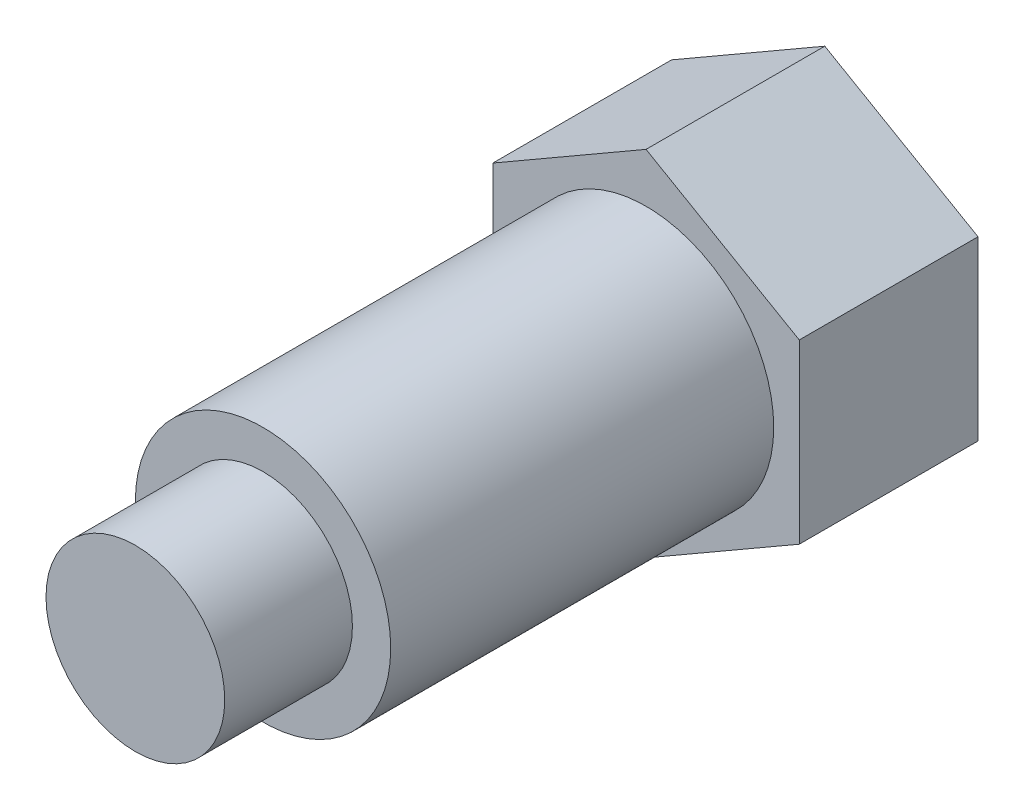
ISO-10303-21;
HEADER;
FILE_DESCRIPTION(('STEP AP214'),'2;1');
FILE_NAME('part.step','',(''),(''),'','','');
FILE_SCHEMA(('AUTOMOTIVE_DESIGN { 1 0 10303 214 1 1 1 1 }'));
ENDSEC;
DATA;
#1=APPLICATION_CONTEXT('core data for automotive mechanical design processes');
#2=APPLICATION_PROTOCOL_DEFINITION('international standard','automotive_design',2000,#1);
#3=PRODUCT_CONTEXT('',#1,'mechanical');
#4=PRODUCT('Part','Part','',(#3));
#5=PRODUCT_RELATED_PRODUCT_CATEGORY('part','',(#4));
#6=PRODUCT_DEFINITION_FORMATION('','',#4);
#7=PRODUCT_DEFINITION_CONTEXT('part definition',#1,'design');
#8=PRODUCT_DEFINITION('design','',#6,#7);
#9=PRODUCT_DEFINITION_SHAPE('','',#8);
#10=(LENGTH_UNIT() NAMED_UNIT(*) SI_UNIT(.MILLI.,.METRE.));
#11=(NAMED_UNIT(*) PLANE_ANGLE_UNIT() SI_UNIT($,.RADIAN.));
#12=(NAMED_UNIT(*) SI_UNIT($,.STERADIAN.) SOLID_ANGLE_UNIT());
#13=UNCERTAINTY_MEASURE_WITH_UNIT(LENGTH_MEASURE(1.E-05),#10,'distance_accuracy_value','');
#14=(GEOMETRIC_REPRESENTATION_CONTEXT(3) GLOBAL_UNCERTAINTY_ASSIGNED_CONTEXT((#13)) GLOBAL_UNIT_ASSIGNED_CONTEXT((#10,
#11,#12)) REPRESENTATION_CONTEXT('',''));
#15=CARTESIAN_POINT('',(0.,0.,0.));
#16=DIRECTION('',(0.,0.,1.));
#17=DIRECTION('',(1.,0.,0.));
#18=AXIS2_PLACEMENT_3D('',#15,#16,#17);
#19=CARTESIAN_POINT('',(0.,0.,20.));
#20=DIRECTION('',(0.,0.,-1.));
#21=DIRECTION('',(-1.,0.,0.));
#22=AXIS2_PLACEMENT_3D('',#19,#20,#21);
#23=PLANE('',#22);
#24=CARTESIAN_POINT('',(0.,0.,20.));
#25=DIRECTION('',(0.,0.,-1.));
#26=DIRECTION('',(-1.,0.,0.));
#27=AXIS2_PLACEMENT_3D('',#24,#25,#26);
#28=CIRCLE('',#27,3.5);
#29=CARTESIAN_POINT('',(-3.50000000000001,0.,20.));
#30=VERTEX_POINT('',#29);
#31=EDGE_CURVE('E11',#30,#30,#28,.T.);
#32=ORIENTED_EDGE('',*,*,#31,.F.);
#33=EDGE_LOOP('',(#32));
#34=FACE_BOUND('',#33,.T.);
#35=ADVANCED_FACE('F37',(#34),#23,.F.);
#36=CARTESIAN_POINT('',(0.,0.,-1.18729932832295));
#37=DIRECTION('',(0.,0.,-1.));
#38=DIRECTION('',(-1.,0.,0.));
#39=AXIS2_PLACEMENT_3D('',#36,#37,#38);
#40=CYLINDRICAL_SURFACE('',#39,3.5);
#41=CARTESIAN_POINT('',(0.,0.,15.));
#42=DIRECTION('',(0.,0.,-1.));
#43=DIRECTION('',(-1.,0.,0.));
#44=AXIS2_PLACEMENT_3D('',#41,#42,#43);
#45=CIRCLE('',#44,3.5);
#46=CARTESIAN_POINT('',(-3.50000000000001,0.,15.));
#47=VERTEX_POINT('',#46);
#48=EDGE_CURVE('E45',#47,#47,#45,.T.);
#49=ORIENTED_EDGE('',*,*,#48,.F.);
#50=EDGE_LOOP('',(#49));
#51=FACE_BOUND('',#50,.T.);
#52=ORIENTED_EDGE('',*,*,#31,.T.);
#53=EDGE_LOOP('',(#52));
#54=FACE_BOUND('',#53,.T.);
#55=ADVANCED_FACE('F151',(#51,#54),#40,.T.);
#56=CARTESIAN_POINT('',(3.5,0.,15.));
#57=DIRECTION('',(0.,0.,-1.));
#58=DIRECTION('',(-1.,0.,0.));
#59=AXIS2_PLACEMENT_3D('',#56,#57,#58);
#60=PLANE('',#59);
#61=CARTESIAN_POINT('',(0.,0.,15.));
#62=DIRECTION('',(0.,0.,-1.));
#63=DIRECTION('',(-1.,0.,0.));
#64=AXIS2_PLACEMENT_3D('',#61,#62,#63);
#65=CIRCLE('',#64,5.);
#66=CARTESIAN_POINT('',(-5.00000000000001,0.,15.));
#67=VERTEX_POINT('',#66);
#68=EDGE_CURVE('E144',#67,#67,#65,.T.);
#69=ORIENTED_EDGE('',*,*,#68,.F.);
#70=EDGE_LOOP('',(#69));
#71=FACE_BOUND('',#70,.T.);
#72=ORIENTED_EDGE('',*,*,#48,.T.);
#73=EDGE_LOOP('',(#72));
#74=FACE_BOUND('',#73,.T.);
#75=ADVANCED_FACE('F149',(#71,#74),#60,.F.);
#76=CARTESIAN_POINT('',(0.,0.,-1.18729932832295));
#77=DIRECTION('',(0.,0.,-1.));
#78=DIRECTION('',(-1.,0.,0.));
#79=AXIS2_PLACEMENT_3D('',#76,#77,#78);
#80=CYLINDRICAL_SURFACE('',#79,5.00000000000001);
#81=CARTESIAN_POINT('',(0.,0.,0.));
#82=DIRECTION('',(0.,0.,-1.));
#83=DIRECTION('',(-1.,0.,0.));
#84=AXIS2_PLACEMENT_3D('',#81,#82,#83);
#85=CIRCLE('',#84,5.00000000000001);
#86=CARTESIAN_POINT('',(-5.00000000000001,0.,0.));
#87=VERTEX_POINT('',#86);
#88=EDGE_CURVE('E141',#87,#87,#85,.T.);
#89=ORIENTED_EDGE('',*,*,#88,.F.);
#90=EDGE_LOOP('',(#89));
#91=FACE_BOUND('',#90,.T.);
#92=ORIENTED_EDGE('',*,*,#68,.T.);
#93=EDGE_LOOP('',(#92));
#94=FACE_BOUND('',#93,.T.);
#95=ADVANCED_FACE('F170',(#91,#94),#80,.T.);
#96=CARTESIAN_POINT('',(0.,-6.92820323027551,-7.));
#97=DIRECTION('',(0.5,0.866025403784439,0.));
#98=DIRECTION('',(-0.866025403784439,0.5,0.));
#99=AXIS2_PLACEMENT_3D('',#96,#97,#98);
#100=PLANE('',#99);
#101=DIRECTION('',(-0.866025403784439,0.5,0.));
#102=VECTOR('',#101,1.);
#103=CARTESIAN_POINT('',(0.,-6.92820323027551,0.));
#104=LINE('',#103,#102);
#105=CARTESIAN_POINT('',(0.,-6.92820323027551,0.));
#106=VERTEX_POINT('',#105);
#107=CARTESIAN_POINT('',(-6.,-3.46410161513776,0.));
#108=VERTEX_POINT('',#107);
#109=EDGE_CURVE('E122',#106,#108,#104,.T.);
#110=ORIENTED_EDGE('',*,*,#109,.T.);
#111=DIRECTION('',(0.,0.,1.));
#112=VECTOR('',#111,1.);
#113=CARTESIAN_POINT('',(-6.,-3.46410161513776,-7.));
#114=LINE('',#113,#112);
#115=CARTESIAN_POINT('',(-6.,-3.46410161513776,-7.));
#116=VERTEX_POINT('',#115);
#117=EDGE_CURVE('E139',#116,#108,#114,.T.);
#118=ORIENTED_EDGE('',*,*,#117,.F.);
#119=DIRECTION('',(-0.866025403784439,0.5,0.));
#120=VECTOR('',#119,1.);
#121=CARTESIAN_POINT('',(0.,-6.92820323027551,-7.));
#122=LINE('',#121,#120);
#123=CARTESIAN_POINT('',(0.,-6.92820323027551,-7.));
#124=VERTEX_POINT('',#123);
#125=EDGE_CURVE('E132',#124,#116,#122,.T.);
#126=ORIENTED_EDGE('',*,*,#125,.F.);
#127=DIRECTION('',(0.,0.,1.));
#128=VECTOR('',#127,1.);
#129=CARTESIAN_POINT('',(0.,-6.92820323027551,-7.));
#130=LINE('',#129,#128);
#131=EDGE_CURVE('E118',#124,#106,#130,.T.);
#132=ORIENTED_EDGE('',*,*,#131,.T.);
#133=EDGE_LOOP('',(#110,#118,#126,#132));
#134=FACE_BOUND('',#133,.T.);
#135=ADVANCED_FACE('F179',(#134),#100,.F.);
#136=CARTESIAN_POINT('',(-6.,-3.46410161513776,-7.));
#137=DIRECTION('',(1.,0.,0.));
#138=DIRECTION('',(0.,1.,0.));
#139=AXIS2_PLACEMENT_3D('',#136,#137,#138);
#140=PLANE('',#139);
#141=DIRECTION('',(0.,1.,0.));
#142=VECTOR('',#141,1.);
#143=CARTESIAN_POINT('',(-6.,-3.46410161513776,0.));
#144=LINE('',#143,#142);
#145=CARTESIAN_POINT('',(-6.,3.46410161513776,0.));
#146=VERTEX_POINT('',#145);
#147=EDGE_CURVE('E125',#108,#146,#144,.T.);
#148=ORIENTED_EDGE('',*,*,#147,.T.);
#149=DIRECTION('',(0.,0.,1.));
#150=VECTOR('',#149,1.);
#151=CARTESIAN_POINT('',(-6.,3.46410161513776,-7.));
#152=LINE('',#151,#150);
#153=CARTESIAN_POINT('',(-6.,3.46410161513776,-7.));
#154=VERTEX_POINT('',#153);
#155=EDGE_CURVE('E136',#154,#146,#152,.T.);
#156=ORIENTED_EDGE('',*,*,#155,.F.);
#157=DIRECTION('',(0.,1.,0.));
#158=VECTOR('',#157,1.);
#159=CARTESIAN_POINT('',(-6.,-3.46410161513776,-7.));
#160=LINE('',#159,#158);
#161=EDGE_CURVE('E91',#116,#154,#160,.T.);
#162=ORIENTED_EDGE('',*,*,#161,.F.);
#163=ORIENTED_EDGE('',*,*,#117,.T.);
#164=EDGE_LOOP('',(#148,#156,#162,#163));
#165=FACE_BOUND('',#164,.T.);
#166=ADVANCED_FACE('F187',(#165),#140,.F.);
#167=CARTESIAN_POINT('',(-6.,3.46410161513776,-7.));
#168=DIRECTION('',(0.5,-0.866025403784439,0.));
#169=DIRECTION('',(0.866025403784439,0.5,0.));
#170=AXIS2_PLACEMENT_3D('',#167,#168,#169);
#171=PLANE('',#170);
#172=DIRECTION('',(0.866025403784439,0.5,0.));
#173=VECTOR('',#172,1.);
#174=CARTESIAN_POINT('',(-6.,3.46410161513776,0.));
#175=LINE('',#174,#173);
#176=CARTESIAN_POINT('',(0.,6.92820323027551,0.));
#177=VERTEX_POINT('',#176);
#178=EDGE_CURVE('E127',#146,#177,#175,.T.);
#179=ORIENTED_EDGE('',*,*,#178,.T.);
#180=DIRECTION('',(0.,0.,1.));
#181=VECTOR('',#180,1.);
#182=CARTESIAN_POINT('',(0.,6.92820323027551,-7.));
#183=LINE('',#182,#181);
#184=CARTESIAN_POINT('',(0.,6.92820323027551,-7.));
#185=VERTEX_POINT('',#184);
#186=EDGE_CURVE('E113',#185,#177,#183,.T.);
#187=ORIENTED_EDGE('',*,*,#186,.F.);
#188=DIRECTION('',(0.866025403784439,0.5,0.));
#189=VECTOR('',#188,1.);
#190=CARTESIAN_POINT('',(-6.,3.46410161513776,-7.));
#191=LINE('',#190,#189);
#192=EDGE_CURVE('E104',#154,#185,#191,.T.);
#193=ORIENTED_EDGE('',*,*,#192,.F.);
#194=ORIENTED_EDGE('',*,*,#155,.T.);
#195=EDGE_LOOP('',(#179,#187,#193,#194));
#196=FACE_BOUND('',#195,.T.);
#197=ADVANCED_FACE('F195',(#196),#171,.F.);
#198=CARTESIAN_POINT('',(0.,6.92820323027551,-7.));
#199=DIRECTION('',(-0.5,-0.866025403784439,0.));
#200=DIRECTION('',(0.866025403784439,-0.5,0.));
#201=AXIS2_PLACEMENT_3D('',#198,#199,#200);
#202=PLANE('',#201);
#203=DIRECTION('',(0.866025403784439,-0.5,0.));
#204=VECTOR('',#203,1.);
#205=CARTESIAN_POINT('',(0.,6.92820323027551,0.));
#206=LINE('',#205,#204);
#207=CARTESIAN_POINT('',(6.,3.46410161513776,0.));
#208=VERTEX_POINT('',#207);
#209=EDGE_CURVE('E112',#177,#208,#206,.T.);
#210=ORIENTED_EDGE('',*,*,#209,.T.);
#211=DIRECTION('',(0.,0.,1.));
#212=VECTOR('',#211,1.);
#213=CARTESIAN_POINT('',(6.,3.46410161513776,-7.));
#214=LINE('',#213,#212);
#215=CARTESIAN_POINT('',(6.,3.46410161513776,-7.));
#216=VERTEX_POINT('',#215);
#217=EDGE_CURVE('E109',#216,#208,#214,.T.);
#218=ORIENTED_EDGE('',*,*,#217,.F.);
#219=DIRECTION('',(0.866025403784439,-0.5,0.));
#220=VECTOR('',#219,1.);
#221=CARTESIAN_POINT('',(0.,6.92820323027551,-7.));
#222=LINE('',#221,#220);
#223=EDGE_CURVE('E98',#185,#216,#222,.T.);
#224=ORIENTED_EDGE('',*,*,#223,.F.);
#225=ORIENTED_EDGE('',*,*,#186,.T.);
#226=EDGE_LOOP('',(#210,#218,#224,#225));
#227=FACE_BOUND('',#226,.T.);
#228=ADVANCED_FACE('F110',(#227),#202,.F.);
#229=CARTESIAN_POINT('',(6.,3.46410161513776,-7.));
#230=DIRECTION('',(-1.,0.,0.));
#231=DIRECTION('',(0.,0.,1.));
#232=AXIS2_PLACEMENT_3D('',#229,#230,#231);
#233=PLANE('',#232);
#234=DIRECTION('',(0.,-1.,0.));
#235=VECTOR('',#234,1.);
#236=CARTESIAN_POINT('',(6.,3.46410161513776,0.));
#237=LINE('',#236,#235);
#238=CARTESIAN_POINT('',(6.,-3.46410161513775,0.));
#239=VERTEX_POINT('',#238);
#240=EDGE_CURVE('E76',#208,#239,#237,.T.);
#241=ORIENTED_EDGE('',*,*,#240,.T.);
#242=DIRECTION('',(0.,0.,1.));
#243=VECTOR('',#242,1.);
#244=CARTESIAN_POINT('',(6.,-3.46410161513775,-7.));
#245=LINE('',#244,#243);
#246=CARTESIAN_POINT('',(6.,-3.46410161513775,-7.));
#247=VERTEX_POINT('',#246);
#248=EDGE_CURVE('E114',#247,#239,#245,.T.);
#249=ORIENTED_EDGE('',*,*,#248,.F.);
#250=DIRECTION('',(0.,-1.,0.));
#251=VECTOR('',#250,1.);
#252=CARTESIAN_POINT('',(6.,3.46410161513776,-7.));
#253=LINE('',#252,#251);
#254=EDGE_CURVE('E102',#216,#247,#253,.T.);
#255=ORIENTED_EDGE('',*,*,#254,.F.);
#256=ORIENTED_EDGE('',*,*,#217,.T.);
#257=EDGE_LOOP('',(#241,#249,#255,#256));
#258=FACE_BOUND('',#257,.T.);
#259=ADVANCED_FACE('F116',(#258),#233,.F.);
#260=CARTESIAN_POINT('',(6.,-3.46410161513775,-7.));
#261=DIRECTION('',(-0.5,0.866025403784438,0.));
#262=DIRECTION('',(-0.866025403784439,-0.5,0.));
#263=AXIS2_PLACEMENT_3D('',#260,#261,#262);
#264=PLANE('',#263);
#265=DIRECTION('',(-0.866025403784438,-0.5,0.));
#266=VECTOR('',#265,1.);
#267=CARTESIAN_POINT('',(6.,-3.46410161513775,0.));
#268=LINE('',#267,#266);
#269=EDGE_CURVE('E82',#239,#106,#268,.T.);
#270=ORIENTED_EDGE('',*,*,#269,.T.);
#271=ORIENTED_EDGE('',*,*,#131,.F.);
#272=DIRECTION('',(-0.866025403784438,-0.5,0.));
#273=VECTOR('',#272,1.);
#274=CARTESIAN_POINT('',(6.,-3.46410161513775,-7.));
#275=LINE('',#274,#273);
#276=EDGE_CURVE('E53',#247,#124,#275,.T.);
#277=ORIENTED_EDGE('',*,*,#276,.F.);
#278=ORIENTED_EDGE('',*,*,#248,.T.);
#279=EDGE_LOOP('',(#270,#271,#277,#278));
#280=FACE_BOUND('',#279,.T.);
#281=ADVANCED_FACE('F215',(#280),#264,.F.);
#282=CARTESIAN_POINT('',(6.,-10.3923048454133,-7.));
#283=DIRECTION('',(0.,0.,1.));
#284=DIRECTION('',(1.,0.,0.));
#285=AXIS2_PLACEMENT_3D('',#282,#283,#284);
#286=PLANE('',#285);
#287=ORIENTED_EDGE('',*,*,#125,.T.);
#288=ORIENTED_EDGE('',*,*,#161,.T.);
#289=ORIENTED_EDGE('',*,*,#192,.T.);
#290=ORIENTED_EDGE('',*,*,#223,.T.);
#291=ORIENTED_EDGE('',*,*,#254,.T.);
#292=ORIENTED_EDGE('',*,*,#276,.T.);
#293=EDGE_LOOP('',(#287,#288,#289,#290,#291,#292));
#294=FACE_BOUND('',#293,.T.);
#295=ADVANCED_FACE('F100',(#294),#286,.F.);
#296=CARTESIAN_POINT('',(6.,-10.3923048454133,0.));
#297=DIRECTION('',(0.,0.,1.));
#298=DIRECTION('',(1.,0.,0.));
#299=AXIS2_PLACEMENT_3D('',#296,#297,#298);
#300=PLANE('',#299);
#301=ORIENTED_EDGE('',*,*,#88,.T.);
#302=EDGE_LOOP('',(#301));
#303=FACE_BOUND('',#302,.T.);
#304=ORIENTED_EDGE('',*,*,#109,.F.);
#305=ORIENTED_EDGE('',*,*,#269,.F.);
#306=ORIENTED_EDGE('',*,*,#240,.F.);
#307=ORIENTED_EDGE('',*,*,#209,.F.);
#308=ORIENTED_EDGE('',*,*,#178,.F.);
#309=ORIENTED_EDGE('',*,*,#147,.F.);
#310=EDGE_LOOP('',(#304,#305,#306,#307,#308,#309));
#311=FACE_BOUND('',#310,.T.);
#312=ADVANCED_FACE('F228',(#303,#311),#300,.T.);
#313=CLOSED_SHELL('',(#35,#55,#75,#95,#135,#166,#197,#228,#259,#281,#295,#312));
#314=MANIFOLD_SOLID_BREP('B2',#313);
#315=ADVANCED_BREP_SHAPE_REPRESENTATION('',(#18,#314),#14);
#316=SHAPE_DEFINITION_REPRESENTATION(#9,#315);
ENDSEC;
END-ISO-10303-21;
